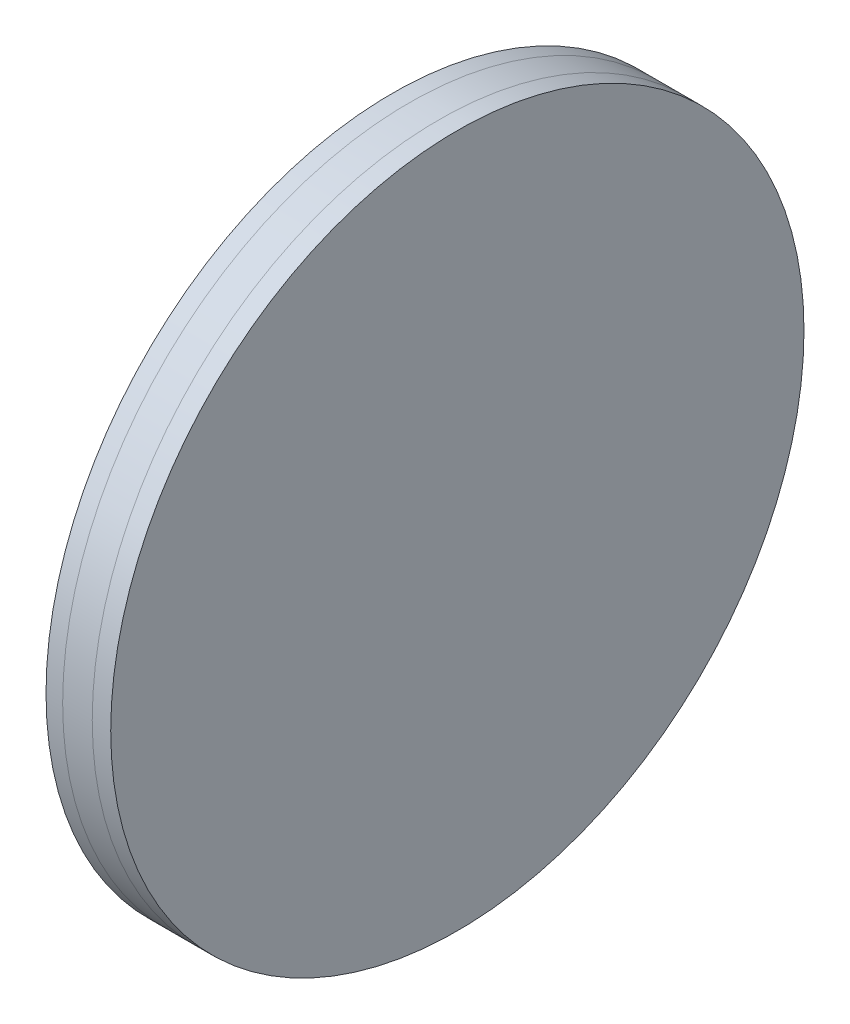
ISO-10303-21;
HEADER;
FILE_DESCRIPTION(('STEP AP214'),'2;1');
FILE_NAME('part.step','',(''),(''),'','','');
FILE_SCHEMA(('AUTOMOTIVE_DESIGN { 1 0 10303 214 1 1 1 1 }'));
ENDSEC;
DATA;
#1=APPLICATION_CONTEXT('core data for automotive mechanical design processes');
#2=APPLICATION_PROTOCOL_DEFINITION('international standard','automotive_design',2000,#1);
#3=PRODUCT_CONTEXT('',#1,'mechanical');
#4=PRODUCT('Part','Part','',(#3));
#5=PRODUCT_RELATED_PRODUCT_CATEGORY('part','',(#4));
#6=PRODUCT_DEFINITION_FORMATION('','',#4);
#7=PRODUCT_DEFINITION_CONTEXT('part definition',#1,'design');
#8=PRODUCT_DEFINITION('design','',#6,#7);
#9=PRODUCT_DEFINITION_SHAPE('','',#8);
#10=(LENGTH_UNIT() NAMED_UNIT(*) SI_UNIT(.MILLI.,.METRE.));
#11=(NAMED_UNIT(*) PLANE_ANGLE_UNIT() SI_UNIT($,.RADIAN.));
#12=(NAMED_UNIT(*) SI_UNIT($,.STERADIAN.) SOLID_ANGLE_UNIT());
#13=UNCERTAINTY_MEASURE_WITH_UNIT(LENGTH_MEASURE(1.E-05),#10,'distance_accuracy_value','');
#14=(GEOMETRIC_REPRESENTATION_CONTEXT(3) GLOBAL_UNCERTAINTY_ASSIGNED_CONTEXT((#13)) GLOBAL_UNIT_ASSIGNED_CONTEXT((#10,
#11,#12)) REPRESENTATION_CONTEXT('',''));
#15=CARTESIAN_POINT('',(0.,0.,0.));
#16=DIRECTION('',(0.,0.,1.));
#17=DIRECTION('',(1.,0.,0.));
#18=AXIS2_PLACEMENT_3D('',#15,#16,#17);
#19=CARTESIAN_POINT('',(0.,0.,0.));
#20=DIRECTION('',(-1.,0.,0.));
#21=DIRECTION('',(0.,0.,1.));
#22=AXIS2_PLACEMENT_3D('',#19,#20,#21);
#23=PLANE('',#22);
#24=CARTESIAN_POINT('',(0.,0.,0.));
#25=DIRECTION('',(1.,0.,0.));
#26=DIRECTION('',(0.,0.,-1.));
#27=AXIS2_PLACEMENT_3D('',#24,#25,#26);
#28=CIRCLE('',#27,27.3249999999998);
#29=CARTESIAN_POINT('',(0.,0.,-27.3249999999998));
#30=VERTEX_POINT('',#29);
#31=EDGE_CURVE('P0_E17',#30,#30,#28,.F.);
#32=ORIENTED_EDGE('',*,*,#31,.T.);
#33=EDGE_LOOP('',(#32));
#34=FACE_BOUND('',#33,.T.);
#35=CARTESIAN_POINT('',(0.,0.,0.));
#36=DIRECTION('',(1.,0.,0.));
#37=DIRECTION('',(0.,0.,-1.));
#38=AXIS2_PLACEMENT_3D('',#35,#36,#37);
#39=CIRCLE('',#38,37.5);
#40=CARTESIAN_POINT('',(0.,0.,-37.5));
#41=VERTEX_POINT('',#40);
#42=EDGE_CURVE('P0_E26',#41,#41,#39,.F.);
#43=ORIENTED_EDGE('',*,*,#42,.F.);
#44=EDGE_LOOP('',(#43));
#45=FACE_BOUND('',#44,.T.);
#46=ADVANCED_FACE('P0_F14',(#34,#45),#23,.F.);
#47=CARTESIAN_POINT('',(-109.266017177982,0.,0.));
#48=DIRECTION('',(1.,0.,0.));
#49=DIRECTION('',(0.,0.,-1.));
#50=AXIS2_PLACEMENT_3D('',#47,#48,#49);
#51=CYLINDRICAL_SURFACE('',#50,27.3249999999998);
#52=CARTESIAN_POINT('',(-3.19999999999999,0.,0.));
#53=DIRECTION('',(1.,0.,0.));
#54=DIRECTION('',(0.,0.,-1.));
#55=AXIS2_PLACEMENT_3D('',#52,#53,#54);
#56=CIRCLE('',#55,27.3249999999998);
#57=CARTESIAN_POINT('',(-3.19999999999999,0.,-27.3249999999998));
#58=VERTEX_POINT('',#57);
#59=EDGE_CURVE('P0_E21',#58,#58,#56,.T.);
#60=ORIENTED_EDGE('',*,*,#59,.F.);
#61=EDGE_LOOP('',(#60));
#62=FACE_BOUND('',#61,.T.);
#63=ORIENTED_EDGE('',*,*,#31,.F.);
#64=EDGE_LOOP('',(#63));
#65=FACE_BOUND('',#64,.T.);
#66=ADVANCED_FACE('P0_F36',(#62,#65),#51,.F.);
#67=CARTESIAN_POINT('',(-109.266017177982,0.,0.));
#68=DIRECTION('',(1.,0.,0.));
#69=DIRECTION('',(0.,0.,-1.));
#70=AXIS2_PLACEMENT_3D('',#67,#68,#69);
#71=CYLINDRICAL_SURFACE('',#70,37.5);
#72=ORIENTED_EDGE('',*,*,#42,.T.);
#73=EDGE_LOOP('',(#72));
#74=FACE_BOUND('',#73,.T.);
#75=CARTESIAN_POINT('',(-3.19999999999999,0.,0.));
#76=DIRECTION('',(1.,0.,0.));
#77=DIRECTION('',(0.,0.,-1.));
#78=AXIS2_PLACEMENT_3D('',#75,#76,#77);
#79=CIRCLE('',#78,37.5);
#80=CARTESIAN_POINT('',(-3.19999999999999,0.,-37.5));
#81=VERTEX_POINT('',#80);
#82=EDGE_CURVE('P0_E10',#81,#81,#79,.F.);
#83=ORIENTED_EDGE('',*,*,#82,.F.);
#84=EDGE_LOOP('',(#83));
#85=FACE_BOUND('',#84,.T.);
#86=ADVANCED_FACE('P0_F38',(#74,#85),#71,.T.);
#87=CARTESIAN_POINT('',(-3.2,27.3249999999998,0.));
#88=DIRECTION('',(-1.,0.,0.));
#89=DIRECTION('',(0.,0.,1.));
#90=AXIS2_PLACEMENT_3D('',#87,#88,#89);
#91=PLANE('',#90);
#92=ORIENTED_EDGE('',*,*,#82,.T.);
#93=EDGE_LOOP('',(#92));
#94=FACE_BOUND('',#93,.T.);
#95=ORIENTED_EDGE('',*,*,#59,.T.);
#96=EDGE_LOOP('',(#95));
#97=FACE_BOUND('',#96,.T.);
#98=ADVANCED_FACE('P0_F45',(#94,#97),#91,.T.);
#99=CLOSED_SHELL('',(#46,#66,#86,#98));
#100=MANIFOLD_SOLID_BREP('P0_B1',#99);
#101=CARTESIAN_POINT('',(2.,35.5,0.));
#102=DIRECTION('',(-1.,0.,0.));
#103=DIRECTION('',(0.,0.,1.));
#104=AXIS2_PLACEMENT_3D('',#101,#102,#103);
#105=PLANE('',#104);
#106=CARTESIAN_POINT('',(2.,0.,0.));
#107=DIRECTION('',(-1.,0.,0.));
#108=DIRECTION('',(0.,0.,1.));
#109=AXIS2_PLACEMENT_3D('',#106,#107,#108);
#110=CIRCLE('',#109,37.5);
#111=CARTESIAN_POINT('',(2.,0.,37.5));
#112=VERTEX_POINT('',#111);
#113=EDGE_CURVE('P1_E17',#112,#112,#110,.T.);
#114=ORIENTED_EDGE('',*,*,#113,.F.);
#115=EDGE_LOOP('',(#114));
#116=FACE_BOUND('',#115,.T.);
#117=ADVANCED_FACE('P1_F14',(#116),#105,.F.);
#118=CARTESIAN_POINT('',(0.,0.,0.));
#119=DIRECTION('',(-1.,0.,0.));
#120=DIRECTION('',(0.,0.,1.));
#121=AXIS2_PLACEMENT_3D('',#118,#119,#120);
#122=CYLINDRICAL_SURFACE('',#121,37.5);
#123=CARTESIAN_POINT('',(0.,0.,0.));
#124=DIRECTION('',(-1.,0.,0.));
#125=DIRECTION('',(0.,0.,1.));
#126=AXIS2_PLACEMENT_3D('',#123,#124,#125);
#127=CIRCLE('',#126,37.5);
#128=CARTESIAN_POINT('',(0.,0.,37.5));
#129=VERTEX_POINT('',#128);
#130=EDGE_CURVE('P1_E33',#129,#129,#127,.F.);
#131=ORIENTED_EDGE('',*,*,#130,.T.);
#132=EDGE_LOOP('',(#131));
#133=FACE_BOUND('',#132,.T.);
#134=ORIENTED_EDGE('',*,*,#113,.T.);
#135=EDGE_LOOP('',(#134));
#136=FACE_BOUND('',#135,.T.);
#137=ADVANCED_FACE('P1_F40',(#133,#136),#122,.T.);
#138=CARTESIAN_POINT('',(0.,37.5,0.));
#139=DIRECTION('',(1.,0.,0.));
#140=DIRECTION('',(0.,0.,-1.));
#141=AXIS2_PLACEMENT_3D('',#138,#139,#140);
#142=PLANE('',#141);
#143=ORIENTED_EDGE('',*,*,#130,.F.);
#144=EDGE_LOOP('',(#143));
#145=FACE_BOUND('',#144,.T.);
#146=CARTESIAN_POINT('',(0.,0.,0.));
#147=DIRECTION('',(-1.,0.,0.));
#148=DIRECTION('',(0.,0.,1.));
#149=AXIS2_PLACEMENT_3D('',#146,#147,#148);
#150=CIRCLE('',#149,27.3249999999998);
#151=CARTESIAN_POINT('',(0.,0.,27.3249999999998));
#152=VERTEX_POINT('',#151);
#153=EDGE_CURVE('P1_E31',#152,#152,#150,.T.);
#154=ORIENTED_EDGE('',*,*,#153,.F.);
#155=EDGE_LOOP('',(#154));
#156=FACE_BOUND('',#155,.T.);
#157=ADVANCED_FACE('P1_F47',(#145,#156),#142,.F.);
#158=CARTESIAN_POINT('',(0.,0.,0.));
#159=DIRECTION('',(-1.,0.,0.));
#160=DIRECTION('',(0.,0.,1.));
#161=AXIS2_PLACEMENT_3D('',#158,#159,#160);
#162=CYLINDRICAL_SURFACE('',#161,27.3249999999998);
#163=CARTESIAN_POINT('',(-3.2,0.,0.));
#164=DIRECTION('',(-1.,0.,0.));
#165=DIRECTION('',(0.,0.,1.));
#166=AXIS2_PLACEMENT_3D('',#163,#164,#165);
#167=CIRCLE('',#166,27.3249999999998);
#168=CARTESIAN_POINT('',(-3.2,0.,27.3249999999998));
#169=VERTEX_POINT('',#168);
#170=EDGE_CURVE('P1_E26',#169,#169,#167,.F.);
#171=ORIENTED_EDGE('',*,*,#170,.T.);
#172=EDGE_LOOP('',(#171));
#173=FACE_BOUND('',#172,.T.);
#174=ORIENTED_EDGE('',*,*,#153,.T.);
#175=EDGE_LOOP('',(#174));
#176=FACE_BOUND('',#175,.T.);
#177=ADVANCED_FACE('P1_F61',(#173,#176),#162,.T.);
#178=CARTESIAN_POINT('',(-3.2,27.3249999999998,0.));
#179=DIRECTION('',(-1.,0.,0.));
#180=DIRECTION('',(0.,0.,1.));
#181=AXIS2_PLACEMENT_3D('',#178,#179,#180);
#182=PLANE('',#181);
#183=ORIENTED_EDGE('',*,*,#170,.F.);
#184=EDGE_LOOP('',(#183));
#185=FACE_BOUND('',#184,.T.);
#186=CARTESIAN_POINT('',(-3.2,0.,0.));
#187=DIRECTION('',(-1.,0.,0.));
#188=DIRECTION('',(0.,0.,1.));
#189=AXIS2_PLACEMENT_3D('',#186,#187,#188);
#190=CIRCLE('',#189,37.5);
#191=CARTESIAN_POINT('',(-3.2,0.,37.5));
#192=VERTEX_POINT('',#191);
#193=EDGE_CURVE('P1_E21',#192,#192,#190,.T.);
#194=ORIENTED_EDGE('',*,*,#193,.F.);
#195=EDGE_LOOP('',(#194));
#196=FACE_BOUND('',#195,.T.);
#197=ADVANCED_FACE('P1_F56',(#185,#196),#182,.F.);
#198=CARTESIAN_POINT('',(0.,0.,0.));
#199=DIRECTION('',(-1.,0.,0.));
#200=DIRECTION('',(0.,0.,1.));
#201=AXIS2_PLACEMENT_3D('',#198,#199,#200);
#202=CYLINDRICAL_SURFACE('',#201,37.5);
#203=CARTESIAN_POINT('',(-5.,0.,0.));
#204=DIRECTION('',(-1.,0.,0.));
#205=DIRECTION('',(0.,0.,1.));
#206=AXIS2_PLACEMENT_3D('',#203,#204,#205);
#207=CIRCLE('',#206,37.5);
#208=CARTESIAN_POINT('',(-5.,0.,37.5));
#209=VERTEX_POINT('',#208);
#210=EDGE_CURVE('P1_E10',#209,#209,#207,.F.);
#211=ORIENTED_EDGE('',*,*,#210,.T.);
#212=EDGE_LOOP('',(#211));
#213=FACE_BOUND('',#212,.T.);
#214=ORIENTED_EDGE('',*,*,#193,.T.);
#215=EDGE_LOOP('',(#214));
#216=FACE_BOUND('',#215,.T.);
#217=ADVANCED_FACE('P1_F50',(#213,#216),#202,.T.);
#218=CARTESIAN_POINT('',(-5.,34.2,0.));
#219=DIRECTION('',(1.,0.,0.));
#220=DIRECTION('',(0.,0.,-1.));
#221=AXIS2_PLACEMENT_3D('',#218,#219,#220);
#222=PLANE('',#221);
#223=ORIENTED_EDGE('',*,*,#210,.F.);
#224=EDGE_LOOP('',(#223));
#225=FACE_BOUND('',#224,.T.);
#226=ADVANCED_FACE('P1_F48',(#225),#222,.F.);
#227=CLOSED_SHELL('',(#117,#137,#157,#177,#197,#217,#226));
#228=MANIFOLD_SOLID_BREP('P1_B1',#227);
#229=ADVANCED_BREP_SHAPE_REPRESENTATION('',(#18,#100,#228),#14);
#230=SHAPE_DEFINITION_REPRESENTATION(#9,#229);
ENDSEC;
END-ISO-10303-21;
